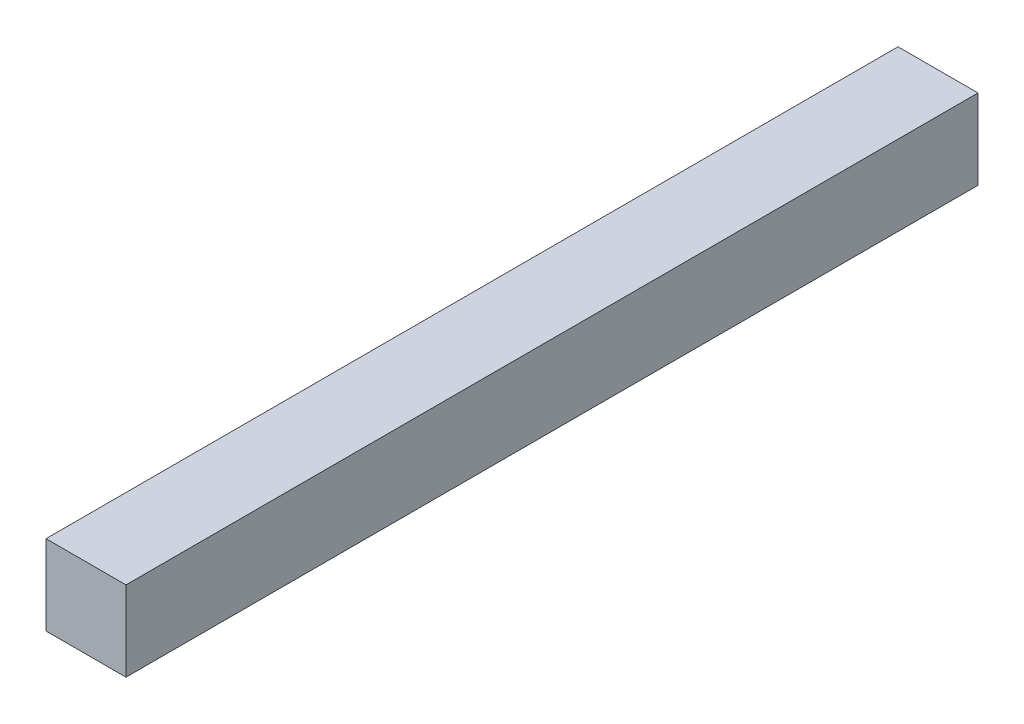
ISO-10303-21;
HEADER;
FILE_DESCRIPTION(('STEP AP214'),'2;1');
FILE_NAME('part.step','',(''),(''),'','','');
FILE_SCHEMA(('AUTOMOTIVE_DESIGN { 1 0 10303 214 1 1 1 1 }'));
ENDSEC;
DATA;
#1=APPLICATION_CONTEXT('core data for automotive mechanical design processes');
#2=APPLICATION_PROTOCOL_DEFINITION('international standard','automotive_design',2000,#1);
#3=PRODUCT_CONTEXT('',#1,'mechanical');
#4=PRODUCT('Part','Part','',(#3));
#5=PRODUCT_RELATED_PRODUCT_CATEGORY('part','',(#4));
#6=PRODUCT_DEFINITION_FORMATION('','',#4);
#7=PRODUCT_DEFINITION_CONTEXT('part definition',#1,'design');
#8=PRODUCT_DEFINITION('design','',#6,#7);
#9=PRODUCT_DEFINITION_SHAPE('','',#8);
#10=(LENGTH_UNIT() NAMED_UNIT(*) SI_UNIT(.MILLI.,.METRE.));
#11=(NAMED_UNIT(*) PLANE_ANGLE_UNIT() SI_UNIT($,.RADIAN.));
#12=(NAMED_UNIT(*) SI_UNIT($,.STERADIAN.) SOLID_ANGLE_UNIT());
#13=UNCERTAINTY_MEASURE_WITH_UNIT(LENGTH_MEASURE(1.E-05),#10,'distance_accuracy_value','');
#14=(GEOMETRIC_REPRESENTATION_CONTEXT(3) GLOBAL_UNCERTAINTY_ASSIGNED_CONTEXT((#13)) GLOBAL_UNIT_ASSIGNED_CONTEXT((#10,
#11,#12)) REPRESENTATION_CONTEXT('',''));
#15=CARTESIAN_POINT('',(0.,0.,0.));
#16=DIRECTION('',(0.,0.,1.));
#17=DIRECTION('',(1.,0.,0.));
#18=AXIS2_PLACEMENT_3D('',#15,#16,#17);
#19=CARTESIAN_POINT('',(0.,0.,0.));
#20=DIRECTION('',(-1.,0.,0.));
#21=DIRECTION('',(0.,0.,1.));
#22=AXIS2_PLACEMENT_3D('',#19,#20,#21);
#23=PLANE('',#22);
#24=DIRECTION('',(0.,0.,-1.));
#25=VECTOR('',#24,1.);
#26=CARTESIAN_POINT('',(0.,0.009999980000003,0.));
#27=LINE('',#26,#25);
#28=CARTESIAN_POINT('',(0.,0.009999980000003,0.10651998));
#29=VERTEX_POINT('',#28);
#30=CARTESIAN_POINT('',(0.,0.009999980000003,0.));
#31=VERTEX_POINT('',#30);
#32=EDGE_CURVE('E26',#29,#31,#27,.T.);
#33=ORIENTED_EDGE('',*,*,#32,.T.);
#34=DIRECTION('',(0.,-1.,0.));
#35=VECTOR('',#34,1.);
#36=CARTESIAN_POINT('',(0.,0.,0.));
#37=LINE('',#36,#35);
#38=CARTESIAN_POINT('',(0.,0.,0.));
#39=VERTEX_POINT('',#38);
#40=EDGE_CURVE('E11',#31,#39,#37,.T.);
#41=ORIENTED_EDGE('',*,*,#40,.T.);
#42=DIRECTION('',(0.,0.,1.));
#43=VECTOR('',#42,1.);
#44=CARTESIAN_POINT('',(0.,0.,0.));
#45=LINE('',#44,#43);
#46=CARTESIAN_POINT('',(0.,0.,0.10651998));
#47=VERTEX_POINT('',#46);
#48=EDGE_CURVE('E78',#39,#47,#45,.T.);
#49=ORIENTED_EDGE('',*,*,#48,.T.);
#50=DIRECTION('',(0.,1.,0.));
#51=VECTOR('',#50,1.);
#52=CARTESIAN_POINT('',(0.,0.,0.10651998));
#53=LINE('',#52,#51);
#54=EDGE_CURVE('E20',#47,#29,#53,.T.);
#55=ORIENTED_EDGE('',*,*,#54,.T.);
#56=EDGE_LOOP('',(#33,#41,#49,#55));
#57=FACE_BOUND('',#56,.T.);
#58=ADVANCED_FACE('F17',(#57),#23,.T.);
#59=CARTESIAN_POINT('',(0.,0.,0.));
#60=DIRECTION('',(0.,0.,1.));
#61=DIRECTION('',(1.,0.,0.));
#62=AXIS2_PLACEMENT_3D('',#59,#60,#61);
#63=PLANE('',#62);
#64=DIRECTION('',(-1.,0.,0.));
#65=VECTOR('',#64,1.);
#66=CARTESIAN_POINT('',(0.,0.009999980000003,0.));
#67=LINE('',#66,#65);
#68=CARTESIAN_POINT('',(0.009999980000003,0.009999980000003,0.));
#69=VERTEX_POINT('',#68);
#70=EDGE_CURVE('E85',#69,#31,#67,.T.);
#71=ORIENTED_EDGE('',*,*,#70,.F.);
#72=DIRECTION('',(0.,1.,0.));
#73=VECTOR('',#72,1.);
#74=CARTESIAN_POINT('',(0.009999980000003,0.,0.));
#75=LINE('',#74,#73);
#76=CARTESIAN_POINT('',(0.009999980000003,0.,0.));
#77=VERTEX_POINT('',#76);
#78=EDGE_CURVE('E83',#77,#69,#75,.T.);
#79=ORIENTED_EDGE('',*,*,#78,.F.);
#80=DIRECTION('',(1.,0.,0.));
#81=VECTOR('',#80,1.);
#82=CARTESIAN_POINT('',(0.,0.,0.));
#83=LINE('',#82,#81);
#84=EDGE_CURVE('E71',#39,#77,#83,.T.);
#85=ORIENTED_EDGE('',*,*,#84,.F.);
#86=ORIENTED_EDGE('',*,*,#40,.F.);
#87=EDGE_LOOP('',(#71,#79,#85,#86));
#88=FACE_BOUND('',#87,.T.);
#89=ADVANCED_FACE('F84',(#88),#63,.F.);
#90=CARTESIAN_POINT('',(0.,0.009999980000003,0.));
#91=DIRECTION('',(0.,1.,0.));
#92=DIRECTION('',(1.,0.,0.));
#93=AXIS2_PLACEMENT_3D('',#90,#91,#92);
#94=PLANE('',#93);
#95=DIRECTION('',(0.,0.,-1.));
#96=VECTOR('',#95,1.);
#97=CARTESIAN_POINT('',(0.009999980000003,0.009999980000003,0.));
#98=LINE('',#97,#96);
#99=CARTESIAN_POINT('',(0.009999980000003,0.009999980000003,0.10651998));
#100=VERTEX_POINT('',#99);
#101=EDGE_CURVE('E90',#100,#69,#98,.T.);
#102=ORIENTED_EDGE('',*,*,#101,.T.);
#103=ORIENTED_EDGE('',*,*,#70,.T.);
#104=ORIENTED_EDGE('',*,*,#32,.F.);
#105=DIRECTION('',(1.,0.,0.));
#106=VECTOR('',#105,1.);
#107=CARTESIAN_POINT('',(0.,0.009999980000003,0.10651998));
#108=LINE('',#107,#106);
#109=EDGE_CURVE('E113',#29,#100,#108,.T.);
#110=ORIENTED_EDGE('',*,*,#109,.T.);
#111=EDGE_LOOP('',(#102,#103,#104,#110));
#112=FACE_BOUND('',#111,.T.);
#113=ADVANCED_FACE('F124',(#112),#94,.T.);
#114=CARTESIAN_POINT('',(0.,0.,0.10651998));
#115=DIRECTION('',(0.,0.,1.));
#116=DIRECTION('',(1.,0.,0.));
#117=AXIS2_PLACEMENT_3D('',#114,#115,#116);
#118=PLANE('',#117);
#119=ORIENTED_EDGE('',*,*,#109,.F.);
#120=ORIENTED_EDGE('',*,*,#54,.F.);
#121=DIRECTION('',(1.,0.,0.));
#122=VECTOR('',#121,1.);
#123=CARTESIAN_POINT('',(0.,0.,0.10651998));
#124=LINE('',#123,#122);
#125=CARTESIAN_POINT('',(0.009999980000003,0.,0.10651998));
#126=VERTEX_POINT('',#125);
#127=EDGE_CURVE('E80',#47,#126,#124,.T.);
#128=ORIENTED_EDGE('',*,*,#127,.T.);
#129=DIRECTION('',(0.,1.,0.));
#130=VECTOR('',#129,1.);
#131=CARTESIAN_POINT('',(0.009999980000003,0.,0.10651998));
#132=LINE('',#131,#130);
#133=EDGE_CURVE('E95',#126,#100,#132,.T.);
#134=ORIENTED_EDGE('',*,*,#133,.T.);
#135=EDGE_LOOP('',(#119,#120,#128,#134));
#136=FACE_BOUND('',#135,.T.);
#137=ADVANCED_FACE('F123',(#136),#118,.T.);
#138=CARTESIAN_POINT('',(0.009999980000003,0.,0.));
#139=DIRECTION('',(0.,-1.,0.));
#140=DIRECTION('',(0.,0.,-1.));
#141=AXIS2_PLACEMENT_3D('',#138,#139,#140);
#142=PLANE('',#141);
#143=ORIENTED_EDGE('',*,*,#48,.F.);
#144=ORIENTED_EDGE('',*,*,#84,.T.);
#145=DIRECTION('',(0.,0.,1.));
#146=VECTOR('',#145,1.);
#147=CARTESIAN_POINT('',(0.009999980000003,0.,0.));
#148=LINE('',#147,#146);
#149=EDGE_CURVE('E76',#77,#126,#148,.T.);
#150=ORIENTED_EDGE('',*,*,#149,.T.);
#151=ORIENTED_EDGE('',*,*,#127,.F.);
#152=EDGE_LOOP('',(#143,#144,#150,#151));
#153=FACE_BOUND('',#152,.T.);
#154=ADVANCED_FACE('F73',(#153),#142,.T.);
#155=CARTESIAN_POINT('',(0.009999980000003,0.009999980000003,0.));
#156=DIRECTION('',(1.,0.,0.));
#157=DIRECTION('',(0.,1.,0.));
#158=AXIS2_PLACEMENT_3D('',#155,#156,#157);
#159=PLANE('',#158);
#160=ORIENTED_EDGE('',*,*,#149,.F.);
#161=ORIENTED_EDGE('',*,*,#78,.T.);
#162=ORIENTED_EDGE('',*,*,#101,.F.);
#163=ORIENTED_EDGE('',*,*,#133,.F.);
#164=EDGE_LOOP('',(#160,#161,#162,#163));
#165=FACE_BOUND('',#164,.T.);
#166=ADVANCED_FACE('F93',(#165),#159,.T.);
#167=CLOSED_SHELL('',(#58,#89,#113,#137,#154,#166));
#168=MANIFOLD_SOLID_BREP('B1',#167);
#169=ADVANCED_BREP_SHAPE_REPRESENTATION('',(#18,#168),#14);
#170=SHAPE_DEFINITION_REPRESENTATION(#9,#169);
ENDSEC;
END-ISO-10303-21;
